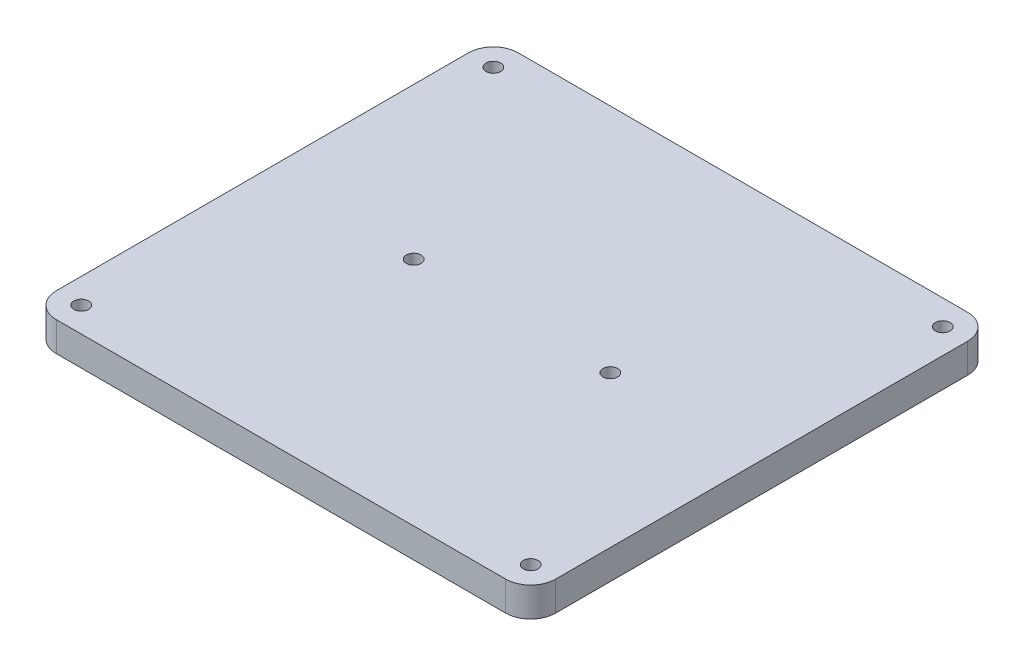
ISO-10303-21;
HEADER;
FILE_DESCRIPTION(('STEP AP214'),'2;1');
FILE_NAME('part.step','',(''),(''),'','','');
FILE_SCHEMA(('AUTOMOTIVE_DESIGN { 1 0 10303 214 1 1 1 1 }'));
ENDSEC;
DATA;
#1=APPLICATION_CONTEXT('core data for automotive mechanical design processes');
#2=APPLICATION_PROTOCOL_DEFINITION('international standard','automotive_design',2000,#1);
#3=PRODUCT_CONTEXT('',#1,'mechanical');
#4=PRODUCT('Part','Part','',(#3));
#5=PRODUCT_RELATED_PRODUCT_CATEGORY('part','',(#4));
#6=PRODUCT_DEFINITION_FORMATION('','',#4);
#7=PRODUCT_DEFINITION_CONTEXT('part definition',#1,'design');
#8=PRODUCT_DEFINITION('design','',#6,#7);
#9=PRODUCT_DEFINITION_SHAPE('','',#8);
#10=(LENGTH_UNIT() NAMED_UNIT(*) SI_UNIT(.MILLI.,.METRE.));
#11=(NAMED_UNIT(*) PLANE_ANGLE_UNIT() SI_UNIT($,.RADIAN.));
#12=(NAMED_UNIT(*) SI_UNIT($,.STERADIAN.) SOLID_ANGLE_UNIT());
#13=UNCERTAINTY_MEASURE_WITH_UNIT(LENGTH_MEASURE(1.E-05),#10,'distance_accuracy_value','');
#14=(GEOMETRIC_REPRESENTATION_CONTEXT(3) GLOBAL_UNCERTAINTY_ASSIGNED_CONTEXT((#13)) GLOBAL_UNIT_ASSIGNED_CONTEXT((#10,
#11,#12)) REPRESENTATION_CONTEXT('',''));
#15=CARTESIAN_POINT('',(0.,0.,0.));
#16=DIRECTION('',(0.,0.,1.));
#17=DIRECTION('',(1.,0.,0.));
#18=AXIS2_PLACEMENT_3D('',#15,#16,#17);
#19=CARTESIAN_POINT('',(0.,3.,0.));
#20=DIRECTION('',(0.,-1.,0.));
#21=DIRECTION('',(0.,0.,-1.));
#22=AXIS2_PLACEMENT_3D('',#19,#20,#21);
#23=PLANE('',#22);
#24=DIRECTION('',(-1.,0.,0.));
#25=VECTOR('',#24,1.);
#26=CARTESIAN_POINT('',(-25.4,3.,-23.5));
#27=LINE('',#26,#25);
#28=CARTESIAN_POINT('',(22.86,3.,-23.5));
#29=VERTEX_POINT('',#28);
#30=CARTESIAN_POINT('',(-22.86,3.,-23.5));
#31=VERTEX_POINT('',#30);
#32=EDGE_CURVE('E136',#29,#31,#27,.T.);
#33=ORIENTED_EDGE('',*,*,#32,.T.);
#34=CARTESIAN_POINT('',(-22.86,3.,-20.96));
#35=DIRECTION('',(0.,-1.,0.));
#36=DIRECTION('',(0.,0.,-1.));
#37=AXIS2_PLACEMENT_3D('',#34,#35,#36);
#38=CIRCLE('',#37,2.54);
#39=CARTESIAN_POINT('',(-25.4,3.,-20.96));
#40=VERTEX_POINT('',#39);
#41=EDGE_CURVE('E155',#31,#40,#38,.F.);
#42=ORIENTED_EDGE('',*,*,#41,.T.);
#43=DIRECTION('',(0.,0.,1.));
#44=VECTOR('',#43,1.);
#45=CARTESIAN_POINT('',(-25.4,3.,23.5));
#46=LINE('',#45,#44);
#47=CARTESIAN_POINT('',(-25.4,3.,20.96));
#48=VERTEX_POINT('',#47);
#49=EDGE_CURVE('E119',#40,#48,#46,.T.);
#50=ORIENTED_EDGE('',*,*,#49,.T.);
#51=CARTESIAN_POINT('',(-22.86,3.,20.96));
#52=DIRECTION('',(0.,-1.,0.));
#53=DIRECTION('',(0.,0.,-1.));
#54=AXIS2_PLACEMENT_3D('',#51,#52,#53);
#55=CIRCLE('',#54,2.54);
#56=CARTESIAN_POINT('',(-22.86,3.,23.5));
#57=VERTEX_POINT('',#56);
#58=EDGE_CURVE('E150',#48,#57,#55,.F.);
#59=ORIENTED_EDGE('',*,*,#58,.T.);
#60=DIRECTION('',(1.,0.,0.));
#61=VECTOR('',#60,1.);
#62=CARTESIAN_POINT('',(-25.4,3.,23.5));
#63=LINE('',#62,#61);
#64=CARTESIAN_POINT('',(22.86,3.,23.5));
#65=VERTEX_POINT('',#64);
#66=EDGE_CURVE('E166',#57,#65,#63,.T.);
#67=ORIENTED_EDGE('',*,*,#66,.T.);
#68=CARTESIAN_POINT('',(22.86,3.,20.96));
#69=DIRECTION('',(0.,-1.,0.));
#70=DIRECTION('',(0.,0.,-1.));
#71=AXIS2_PLACEMENT_3D('',#68,#69,#70);
#72=CIRCLE('',#71,2.54);
#73=CARTESIAN_POINT('',(25.4,3.,20.96));
#74=VERTEX_POINT('',#73);
#75=EDGE_CURVE('E55',#65,#74,#72,.F.);
#76=ORIENTED_EDGE('',*,*,#75,.T.);
#77=DIRECTION('',(0.,0.,-1.));
#78=VECTOR('',#77,1.);
#79=CARTESIAN_POINT('',(25.4,3.,23.5));
#80=LINE('',#79,#78);
#81=CARTESIAN_POINT('',(25.4,3.,-20.96));
#82=VERTEX_POINT('',#81);
#83=EDGE_CURVE('E174',#74,#82,#80,.T.);
#84=ORIENTED_EDGE('',*,*,#83,.T.);
#85=CARTESIAN_POINT('',(22.86,3.,-20.96));
#86=DIRECTION('',(0.,-1.,0.));
#87=DIRECTION('',(0.,0.,-1.));
#88=AXIS2_PLACEMENT_3D('',#85,#86,#87);
#89=CIRCLE('',#88,2.54);
#90=EDGE_CURVE('E153',#82,#29,#89,.F.);
#91=ORIENTED_EDGE('',*,*,#90,.T.);
#92=EDGE_LOOP('',(#33,#42,#50,#59,#67,#76,#84,#91));
#93=FACE_BOUND('',#92,.T.);
#94=CARTESIAN_POINT('',(-22.86,3.,-20.96));
#95=DIRECTION('',(0.,1.,0.));
#96=DIRECTION('',(0.,0.,1.));
#97=AXIS2_PLACEMENT_3D('',#94,#95,#96);
#98=CIRCLE('',#97,0.750000000000002);
#99=CARTESIAN_POINT('',(-22.86,3.,-20.21));
#100=VERTEX_POINT('',#99);
#101=EDGE_CURVE('E127',#100,#100,#98,.T.);
#102=ORIENTED_EDGE('',*,*,#101,.F.);
#103=EDGE_LOOP('',(#102));
#104=FACE_BOUND('',#103,.T.);
#105=CARTESIAN_POINT('',(10.,3.,0.));
#106=DIRECTION('',(0.,1.,0.));
#107=DIRECTION('',(0.,0.,1.));
#108=AXIS2_PLACEMENT_3D('',#105,#106,#107);
#109=CIRCLE('',#108,0.75);
#110=CARTESIAN_POINT('',(10.,3.,0.749999999999997));
#111=VERTEX_POINT('',#110);
#112=EDGE_CURVE('E181',#111,#111,#109,.T.);
#113=ORIENTED_EDGE('',*,*,#112,.F.);
#114=EDGE_LOOP('',(#113));
#115=FACE_BOUND('',#114,.T.);
#116=CARTESIAN_POINT('',(-10.,3.,0.));
#117=DIRECTION('',(0.,1.,0.));
#118=DIRECTION('',(0.,0.,1.));
#119=AXIS2_PLACEMENT_3D('',#116,#117,#118);
#120=CIRCLE('',#119,0.75);
#121=CARTESIAN_POINT('',(-10.,3.,0.75));
#122=VERTEX_POINT('',#121);
#123=EDGE_CURVE('E186',#122,#122,#120,.T.);
#124=ORIENTED_EDGE('',*,*,#123,.F.);
#125=EDGE_LOOP('',(#124));
#126=FACE_BOUND('',#125,.T.);
#127=CARTESIAN_POINT('',(22.86,3.,-20.96));
#128=DIRECTION('',(0.,1.,0.));
#129=DIRECTION('',(0.,0.,-1.));
#130=AXIS2_PLACEMENT_3D('',#127,#128,#129);
#131=CIRCLE('',#130,0.750000000000002);
#132=CARTESIAN_POINT('',(22.86,3.,-21.71));
#133=VERTEX_POINT('',#132);
#134=EDGE_CURVE('E192',#133,#133,#131,.T.);
#135=ORIENTED_EDGE('',*,*,#134,.F.);
#136=EDGE_LOOP('',(#135));
#137=FACE_BOUND('',#136,.T.);
#138=CARTESIAN_POINT('',(22.86,3.,20.96));
#139=DIRECTION('',(0.,1.,0.));
#140=DIRECTION('',(0.,0.,1.));
#141=AXIS2_PLACEMENT_3D('',#138,#139,#140);
#142=CIRCLE('',#141,0.750000000000002);
#143=CARTESIAN_POINT('',(22.86,3.,21.71));
#144=VERTEX_POINT('',#143);
#145=EDGE_CURVE('E198',#144,#144,#142,.T.);
#146=ORIENTED_EDGE('',*,*,#145,.F.);
#147=EDGE_LOOP('',(#146));
#148=FACE_BOUND('',#147,.T.);
#149=CARTESIAN_POINT('',(-22.86,3.,20.96));
#150=DIRECTION('',(0.,1.,0.));
#151=DIRECTION('',(0.,0.,-1.));
#152=AXIS2_PLACEMENT_3D('',#149,#150,#151);
#153=CIRCLE('',#152,0.750000000000002);
#154=CARTESIAN_POINT('',(-22.86,3.,20.21));
#155=VERTEX_POINT('',#154);
#156=EDGE_CURVE('E204',#155,#155,#153,.T.);
#157=ORIENTED_EDGE('',*,*,#156,.F.);
#158=EDGE_LOOP('',(#157));
#159=FACE_BOUND('',#158,.T.);
#160=ADVANCED_FACE('F33',(#93,#104,#115,#126,#137,#148,#159),#23,.F.);
#161=CARTESIAN_POINT('',(0.,0.,0.));
#162=DIRECTION('',(0.,-1.,0.));
#163=DIRECTION('',(0.,0.,-1.));
#164=AXIS2_PLACEMENT_3D('',#161,#162,#163);
#165=PLANE('',#164);
#166=CARTESIAN_POINT('',(22.86,0.,20.96));
#167=DIRECTION('',(0.,1.,0.));
#168=DIRECTION('',(0.,0.,1.));
#169=AXIS2_PLACEMENT_3D('',#166,#167,#168);
#170=CIRCLE('',#169,0.750000000000002);
#171=CARTESIAN_POINT('',(22.86,0.,21.71));
#172=VERTEX_POINT('',#171);
#173=EDGE_CURVE('E201',#172,#172,#170,.T.);
#174=ORIENTED_EDGE('',*,*,#173,.T.);
#175=EDGE_LOOP('',(#174));
#176=FACE_BOUND('',#175,.T.);
#177=CARTESIAN_POINT('',(-10.,0.,0.));
#178=DIRECTION('',(0.,1.,0.));
#179=DIRECTION('',(0.,0.,1.));
#180=AXIS2_PLACEMENT_3D('',#177,#178,#179);
#181=CIRCLE('',#180,0.75);
#182=CARTESIAN_POINT('',(-10.,0.,0.75));
#183=VERTEX_POINT('',#182);
#184=EDGE_CURVE('E189',#183,#183,#181,.T.);
#185=ORIENTED_EDGE('',*,*,#184,.T.);
#186=EDGE_LOOP('',(#185));
#187=FACE_BOUND('',#186,.T.);
#188=CARTESIAN_POINT('',(-22.86,0.,-20.96));
#189=DIRECTION('',(0.,1.,0.));
#190=DIRECTION('',(0.,0.,1.));
#191=AXIS2_PLACEMENT_3D('',#188,#189,#190);
#192=CIRCLE('',#191,0.750000000000002);
#193=CARTESIAN_POINT('',(-22.86,0.,-20.21));
#194=VERTEX_POINT('',#193);
#195=EDGE_CURVE('E133',#194,#194,#192,.T.);
#196=ORIENTED_EDGE('',*,*,#195,.T.);
#197=EDGE_LOOP('',(#196));
#198=FACE_BOUND('',#197,.T.);
#199=DIRECTION('',(0.,0.,1.));
#200=VECTOR('',#199,1.);
#201=CARTESIAN_POINT('',(-25.4,0.,23.5));
#202=LINE('',#201,#200);
#203=CARTESIAN_POINT('',(-25.4,0.,-20.96));
#204=VERTEX_POINT('',#203);
#205=CARTESIAN_POINT('',(-25.4,0.,20.96));
#206=VERTEX_POINT('',#205);
#207=EDGE_CURVE('E116',#204,#206,#202,.T.);
#208=ORIENTED_EDGE('',*,*,#207,.F.);
#209=CARTESIAN_POINT('',(-22.86,0.,-20.96));
#210=DIRECTION('',(0.,-1.,0.));
#211=DIRECTION('',(0.,0.,-1.));
#212=AXIS2_PLACEMENT_3D('',#209,#210,#211);
#213=CIRCLE('',#212,2.54);
#214=CARTESIAN_POINT('',(-22.86,0.,-23.5));
#215=VERTEX_POINT('',#214);
#216=EDGE_CURVE('E99',#204,#215,#213,.T.);
#217=ORIENTED_EDGE('',*,*,#216,.T.);
#218=DIRECTION('',(-1.,0.,0.));
#219=VECTOR('',#218,1.);
#220=CARTESIAN_POINT('',(-25.4,0.,-23.5));
#221=LINE('',#220,#219);
#222=CARTESIAN_POINT('',(22.86,0.,-23.5));
#223=VERTEX_POINT('',#222);
#224=EDGE_CURVE('E140',#223,#215,#221,.T.);
#225=ORIENTED_EDGE('',*,*,#224,.F.);
#226=CARTESIAN_POINT('',(22.86,0.,-20.96));
#227=DIRECTION('',(0.,-1.,0.));
#228=DIRECTION('',(0.,0.,-1.));
#229=AXIS2_PLACEMENT_3D('',#226,#227,#228);
#230=CIRCLE('',#229,2.54);
#231=CARTESIAN_POINT('',(25.4,0.,-20.96));
#232=VERTEX_POINT('',#231);
#233=EDGE_CURVE('E110',#223,#232,#230,.T.);
#234=ORIENTED_EDGE('',*,*,#233,.T.);
#235=DIRECTION('',(0.,0.,-1.));
#236=VECTOR('',#235,1.);
#237=CARTESIAN_POINT('',(25.4,0.,23.5));
#238=LINE('',#237,#236);
#239=CARTESIAN_POINT('',(25.4,0.,20.96));
#240=VERTEX_POINT('',#239);
#241=EDGE_CURVE('E130',#240,#232,#238,.T.);
#242=ORIENTED_EDGE('',*,*,#241,.F.);
#243=CARTESIAN_POINT('',(22.86,0.,20.96));
#244=DIRECTION('',(0.,-1.,0.));
#245=DIRECTION('',(0.,0.,-1.));
#246=AXIS2_PLACEMENT_3D('',#243,#244,#245);
#247=CIRCLE('',#246,2.54);
#248=CARTESIAN_POINT('',(22.86,0.,23.5));
#249=VERTEX_POINT('',#248);
#250=EDGE_CURVE('E144',#240,#249,#247,.T.);
#251=ORIENTED_EDGE('',*,*,#250,.T.);
#252=DIRECTION('',(1.,0.,0.));
#253=VECTOR('',#252,1.);
#254=CARTESIAN_POINT('',(-25.4,0.,23.5));
#255=LINE('',#254,#253);
#256=CARTESIAN_POINT('',(-22.86,0.,23.5));
#257=VERTEX_POINT('',#256);
#258=EDGE_CURVE('E126',#257,#249,#255,.T.);
#259=ORIENTED_EDGE('',*,*,#258,.F.);
#260=CARTESIAN_POINT('',(-22.86,0.,20.96));
#261=DIRECTION('',(0.,-1.,0.));
#262=DIRECTION('',(0.,0.,-1.));
#263=AXIS2_PLACEMENT_3D('',#260,#261,#262);
#264=CIRCLE('',#263,2.54);
#265=EDGE_CURVE('E120',#257,#206,#264,.T.);
#266=ORIENTED_EDGE('',*,*,#265,.T.);
#267=EDGE_LOOP('',(#208,#217,#225,#234,#242,#251,#259,#266));
#268=FACE_BOUND('',#267,.T.);
#269=CARTESIAN_POINT('',(10.,0.,0.));
#270=DIRECTION('',(0.,1.,0.));
#271=DIRECTION('',(0.,0.,1.));
#272=AXIS2_PLACEMENT_3D('',#269,#270,#271);
#273=CIRCLE('',#272,0.75);
#274=CARTESIAN_POINT('',(10.,0.,0.749999999999997));
#275=VERTEX_POINT('',#274);
#276=EDGE_CURVE('E183',#275,#275,#273,.T.);
#277=ORIENTED_EDGE('',*,*,#276,.T.);
#278=EDGE_LOOP('',(#277));
#279=FACE_BOUND('',#278,.T.);
#280=CARTESIAN_POINT('',(22.86,0.,-20.96));
#281=DIRECTION('',(0.,1.,0.));
#282=DIRECTION('',(0.,0.,-1.));
#283=AXIS2_PLACEMENT_3D('',#280,#281,#282);
#284=CIRCLE('',#283,0.750000000000002);
#285=CARTESIAN_POINT('',(22.86,0.,-21.71));
#286=VERTEX_POINT('',#285);
#287=EDGE_CURVE('E195',#286,#286,#284,.T.);
#288=ORIENTED_EDGE('',*,*,#287,.T.);
#289=EDGE_LOOP('',(#288));
#290=FACE_BOUND('',#289,.T.);
#291=CARTESIAN_POINT('',(-22.86,0.,20.96));
#292=DIRECTION('',(0.,1.,0.));
#293=DIRECTION('',(0.,0.,-1.));
#294=AXIS2_PLACEMENT_3D('',#291,#292,#293);
#295=CIRCLE('',#294,0.750000000000002);
#296=CARTESIAN_POINT('',(-22.86,0.,20.21));
#297=VERTEX_POINT('',#296);
#298=EDGE_CURVE('E207',#297,#297,#295,.T.);
#299=ORIENTED_EDGE('',*,*,#298,.T.);
#300=EDGE_LOOP('',(#299));
#301=FACE_BOUND('',#300,.T.);
#302=ADVANCED_FACE('F123',(#176,#187,#198,#268,#279,#290,#301),#165,.T.);
#303=CARTESIAN_POINT('',(-25.4,3.,23.5));
#304=DIRECTION('',(1.,0.,0.));
#305=DIRECTION('',(0.,0.,-1.));
#306=AXIS2_PLACEMENT_3D('',#303,#304,#305);
#307=PLANE('',#306);
#308=ORIENTED_EDGE('',*,*,#49,.F.);
#309=DIRECTION('',(0.,-1.,0.));
#310=VECTOR('',#309,1.);
#311=CARTESIAN_POINT('',(-25.4,3.,-20.96));
#312=LINE('',#311,#310);
#313=EDGE_CURVE('E103',#40,#204,#312,.T.);
#314=ORIENTED_EDGE('',*,*,#313,.T.);
#315=ORIENTED_EDGE('',*,*,#207,.T.);
#316=DIRECTION('',(0.,-1.,0.));
#317=VECTOR('',#316,1.);
#318=CARTESIAN_POINT('',(-25.4,3.,20.96));
#319=LINE('',#318,#317);
#320=EDGE_CURVE('E121',#206,#48,#319,.F.);
#321=ORIENTED_EDGE('',*,*,#320,.T.);
#322=EDGE_LOOP('',(#308,#314,#315,#321));
#323=FACE_BOUND('',#322,.T.);
#324=ADVANCED_FACE('F115',(#323),#307,.F.);
#325=CARTESIAN_POINT('',(-25.4,3.,23.5));
#326=DIRECTION('',(0.,0.,-1.));
#327=DIRECTION('',(-1.,0.,0.));
#328=AXIS2_PLACEMENT_3D('',#325,#326,#327);
#329=PLANE('',#328);
#330=ORIENTED_EDGE('',*,*,#258,.T.);
#331=DIRECTION('',(0.,-1.,0.));
#332=VECTOR('',#331,1.);
#333=CARTESIAN_POINT('',(22.86,3.,23.5));
#334=LINE('',#333,#332);
#335=EDGE_CURVE('E11',#249,#65,#334,.F.);
#336=ORIENTED_EDGE('',*,*,#335,.T.);
#337=ORIENTED_EDGE('',*,*,#66,.F.);
#338=DIRECTION('',(0.,-1.,0.));
#339=VECTOR('',#338,1.);
#340=CARTESIAN_POINT('',(-22.86,3.,23.5));
#341=LINE('',#340,#339);
#342=EDGE_CURVE('E41',#57,#257,#341,.T.);
#343=ORIENTED_EDGE('',*,*,#342,.T.);
#344=EDGE_LOOP('',(#330,#336,#337,#343));
#345=FACE_BOUND('',#344,.T.);
#346=ADVANCED_FACE('F164',(#345),#329,.F.);
#347=CARTESIAN_POINT('',(25.4,3.,23.5));
#348=DIRECTION('',(-1.,0.,0.));
#349=DIRECTION('',(0.,0.,1.));
#350=AXIS2_PLACEMENT_3D('',#347,#348,#349);
#351=PLANE('',#350);
#352=ORIENTED_EDGE('',*,*,#241,.T.);
#353=DIRECTION('',(0.,-1.,0.));
#354=VECTOR('',#353,1.);
#355=CARTESIAN_POINT('',(25.4,3.,-20.96));
#356=LINE('',#355,#354);
#357=EDGE_CURVE('E48',#232,#82,#356,.F.);
#358=ORIENTED_EDGE('',*,*,#357,.T.);
#359=ORIENTED_EDGE('',*,*,#83,.F.);
#360=DIRECTION('',(0.,-1.,0.));
#361=VECTOR('',#360,1.);
#362=CARTESIAN_POINT('',(25.4,3.,20.96));
#363=LINE('',#362,#361);
#364=EDGE_CURVE('E157',#74,#240,#363,.T.);
#365=ORIENTED_EDGE('',*,*,#364,.T.);
#366=EDGE_LOOP('',(#352,#358,#359,#365));
#367=FACE_BOUND('',#366,.T.);
#368=ADVANCED_FACE('F173',(#367),#351,.F.);
#369=CARTESIAN_POINT('',(-25.4,3.,-23.5));
#370=DIRECTION('',(0.,0.,1.));
#371=DIRECTION('',(1.,0.,0.));
#372=AXIS2_PLACEMENT_3D('',#369,#370,#371);
#373=PLANE('',#372);
#374=ORIENTED_EDGE('',*,*,#224,.T.);
#375=DIRECTION('',(0.,-1.,0.));
#376=VECTOR('',#375,1.);
#377=CARTESIAN_POINT('',(-22.86,3.,-23.5));
#378=LINE('',#377,#376);
#379=EDGE_CURVE('E104',#215,#31,#378,.F.);
#380=ORIENTED_EDGE('',*,*,#379,.T.);
#381=ORIENTED_EDGE('',*,*,#32,.F.);
#382=DIRECTION('',(0.,-1.,0.));
#383=VECTOR('',#382,1.);
#384=CARTESIAN_POINT('',(22.86,3.,-23.5));
#385=LINE('',#384,#383);
#386=EDGE_CURVE('E109',#29,#223,#385,.T.);
#387=ORIENTED_EDGE('',*,*,#386,.T.);
#388=EDGE_LOOP('',(#374,#380,#381,#387));
#389=FACE_BOUND('',#388,.T.);
#390=ADVANCED_FACE('F228',(#389),#373,.F.);
#391=CARTESIAN_POINT('',(-22.86,3.,-20.96));
#392=DIRECTION('',(0.,-1.,0.));
#393=DIRECTION('',(0.,0.,-1.));
#394=AXIS2_PLACEMENT_3D('',#391,#392,#393);
#395=CYLINDRICAL_SURFACE('',#394,0.750000000000002);
#396=ORIENTED_EDGE('',*,*,#101,.T.);
#397=EDGE_LOOP('',(#396));
#398=FACE_BOUND('',#397,.T.);
#399=ORIENTED_EDGE('',*,*,#195,.F.);
#400=EDGE_LOOP('',(#399));
#401=FACE_BOUND('',#400,.T.);
#402=ADVANCED_FACE('F225',(#398,#401),#395,.F.);
#403=CARTESIAN_POINT('',(10.,3.,0.));
#404=DIRECTION('',(0.,-1.,0.));
#405=DIRECTION('',(0.,0.,-1.));
#406=AXIS2_PLACEMENT_3D('',#403,#404,#405);
#407=CYLINDRICAL_SURFACE('',#406,0.75);
#408=ORIENTED_EDGE('',*,*,#112,.T.);
#409=EDGE_LOOP('',(#408));
#410=FACE_BOUND('',#409,.T.);
#411=ORIENTED_EDGE('',*,*,#276,.F.);
#412=EDGE_LOOP('',(#411));
#413=FACE_BOUND('',#412,.T.);
#414=ADVANCED_FACE('F341',(#410,#413),#407,.F.);
#415=CARTESIAN_POINT('',(-10.,3.,0.));
#416=DIRECTION('',(0.,-1.,0.));
#417=DIRECTION('',(0.,0.,-1.));
#418=AXIS2_PLACEMENT_3D('',#415,#416,#417);
#419=CYLINDRICAL_SURFACE('',#418,0.75);
#420=ORIENTED_EDGE('',*,*,#123,.T.);
#421=EDGE_LOOP('',(#420));
#422=FACE_BOUND('',#421,.T.);
#423=ORIENTED_EDGE('',*,*,#184,.F.);
#424=EDGE_LOOP('',(#423));
#425=FACE_BOUND('',#424,.T.);
#426=ADVANCED_FACE('F331',(#422,#425),#419,.F.);
#427=CARTESIAN_POINT('',(22.86,3.,-20.96));
#428=DIRECTION('',(0.,-1.,0.));
#429=DIRECTION('',(0.,0.,-1.));
#430=AXIS2_PLACEMENT_3D('',#427,#428,#429);
#431=CYLINDRICAL_SURFACE('',#430,0.750000000000002);
#432=ORIENTED_EDGE('',*,*,#134,.T.);
#433=EDGE_LOOP('',(#432));
#434=FACE_BOUND('',#433,.T.);
#435=ORIENTED_EDGE('',*,*,#287,.F.);
#436=EDGE_LOOP('',(#435));
#437=FACE_BOUND('',#436,.T.);
#438=ADVANCED_FACE('F321',(#434,#437),#431,.F.);
#439=CARTESIAN_POINT('',(22.86,3.,20.96));
#440=DIRECTION('',(0.,-1.,0.));
#441=DIRECTION('',(0.,0.,-1.));
#442=AXIS2_PLACEMENT_3D('',#439,#440,#441);
#443=CYLINDRICAL_SURFACE('',#442,0.750000000000002);
#444=ORIENTED_EDGE('',*,*,#145,.T.);
#445=EDGE_LOOP('',(#444));
#446=FACE_BOUND('',#445,.T.);
#447=ORIENTED_EDGE('',*,*,#173,.F.);
#448=EDGE_LOOP('',(#447));
#449=FACE_BOUND('',#448,.T.);
#450=ADVANCED_FACE('F312',(#446,#449),#443,.F.);
#451=CARTESIAN_POINT('',(-22.86,3.,20.96));
#452=DIRECTION('',(0.,-1.,0.));
#453=DIRECTION('',(0.,0.,-1.));
#454=AXIS2_PLACEMENT_3D('',#451,#452,#453);
#455=CYLINDRICAL_SURFACE('',#454,0.750000000000002);
#456=ORIENTED_EDGE('',*,*,#156,.T.);
#457=EDGE_LOOP('',(#456));
#458=FACE_BOUND('',#457,.T.);
#459=ORIENTED_EDGE('',*,*,#298,.F.);
#460=EDGE_LOOP('',(#459));
#461=FACE_BOUND('',#460,.T.);
#462=ADVANCED_FACE('F213',(#458,#461),#455,.F.);
#463=CARTESIAN_POINT('',(-22.86,3.,-20.96));
#464=DIRECTION('',(0.,-1.,0.));
#465=DIRECTION('',(0.,0.,-1.));
#466=AXIS2_PLACEMENT_3D('',#463,#464,#465);
#467=CYLINDRICAL_SURFACE('',#466,2.54);
#468=ORIENTED_EDGE('',*,*,#41,.F.);
#469=ORIENTED_EDGE('',*,*,#379,.F.);
#470=ORIENTED_EDGE('',*,*,#216,.F.);
#471=ORIENTED_EDGE('',*,*,#313,.F.);
#472=EDGE_LOOP('',(#468,#469,#470,#471));
#473=FACE_BOUND('',#472,.T.);
#474=ADVANCED_FACE('F102',(#473),#467,.T.);
#475=CARTESIAN_POINT('',(22.86,3.,-20.96));
#476=DIRECTION('',(0.,-1.,0.));
#477=DIRECTION('',(0.,0.,-1.));
#478=AXIS2_PLACEMENT_3D('',#475,#476,#477);
#479=CYLINDRICAL_SURFACE('',#478,2.54);
#480=ORIENTED_EDGE('',*,*,#90,.F.);
#481=ORIENTED_EDGE('',*,*,#357,.F.);
#482=ORIENTED_EDGE('',*,*,#233,.F.);
#483=ORIENTED_EDGE('',*,*,#386,.F.);
#484=EDGE_LOOP('',(#480,#481,#482,#483));
#485=FACE_BOUND('',#484,.T.);
#486=ADVANCED_FACE('F240',(#485),#479,.T.);
#487=CARTESIAN_POINT('',(22.86,3.,20.96));
#488=DIRECTION('',(0.,-1.,0.));
#489=DIRECTION('',(0.,0.,-1.));
#490=AXIS2_PLACEMENT_3D('',#487,#488,#489);
#491=CYLINDRICAL_SURFACE('',#490,2.54);
#492=ORIENTED_EDGE('',*,*,#75,.F.);
#493=ORIENTED_EDGE('',*,*,#335,.F.);
#494=ORIENTED_EDGE('',*,*,#250,.F.);
#495=ORIENTED_EDGE('',*,*,#364,.F.);
#496=EDGE_LOOP('',(#492,#493,#494,#495));
#497=FACE_BOUND('',#496,.T.);
#498=ADVANCED_FACE('F172',(#497),#491,.T.);
#499=CARTESIAN_POINT('',(-22.86,3.,20.96));
#500=DIRECTION('',(0.,-1.,0.));
#501=DIRECTION('',(0.,0.,-1.));
#502=AXIS2_PLACEMENT_3D('',#499,#500,#501);
#503=CYLINDRICAL_SURFACE('',#502,2.54);
#504=ORIENTED_EDGE('',*,*,#58,.F.);
#505=ORIENTED_EDGE('',*,*,#320,.F.);
#506=ORIENTED_EDGE('',*,*,#265,.F.);
#507=ORIENTED_EDGE('',*,*,#342,.F.);
#508=EDGE_LOOP('',(#504,#505,#506,#507));
#509=FACE_BOUND('',#508,.T.);
#510=ADVANCED_FACE('F35',(#509),#503,.T.);
#511=CLOSED_SHELL('',(#160,#302,#324,#346,#368,#390,#402,#414,#426,#438,#450,#462,#474,#486,
#498,#510));
#512=MANIFOLD_SOLID_BREP('B2',#511);
#513=ADVANCED_BREP_SHAPE_REPRESENTATION('',(#18,#512),#14);
#514=SHAPE_DEFINITION_REPRESENTATION(#9,#513);
ENDSEC;
END-ISO-10303-21;
